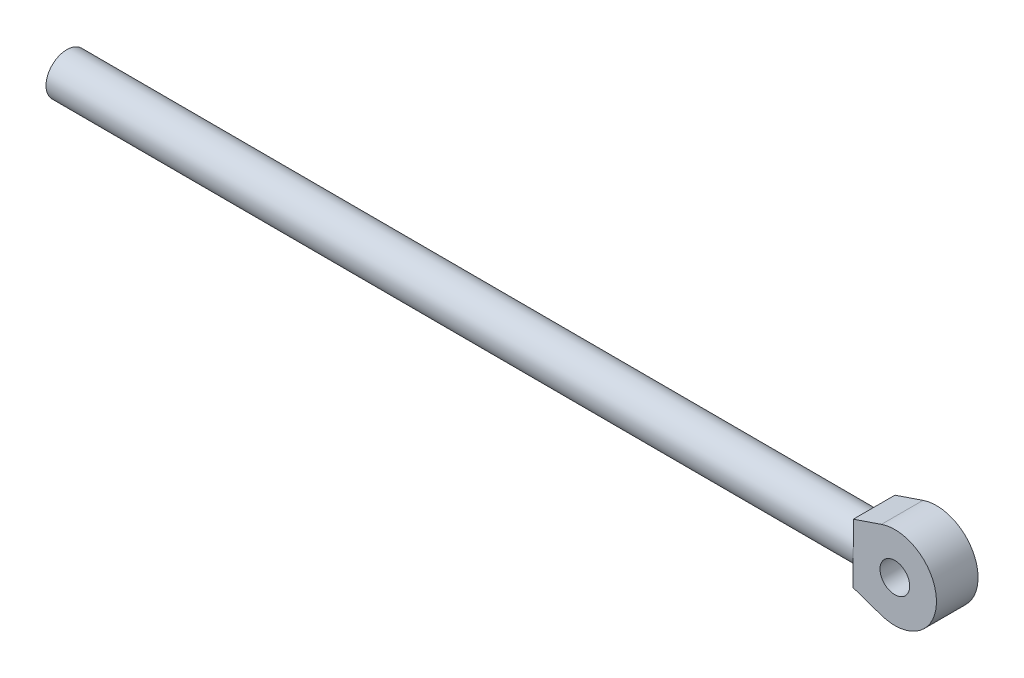
ISO-10303-21;
HEADER;
FILE_DESCRIPTION(('STEP AP214'),'2;1');
FILE_NAME('part.step','',(''),(''),'','','');
FILE_SCHEMA(('AUTOMOTIVE_DESIGN { 1 0 10303 214 1 1 1 1 }'));
ENDSEC;
DATA;
#1=APPLICATION_CONTEXT('core data for automotive mechanical design processes');
#2=APPLICATION_PROTOCOL_DEFINITION('international standard','automotive_design',2000,#1);
#3=PRODUCT_CONTEXT('',#1,'mechanical');
#4=PRODUCT('Part','Part','',(#3));
#5=PRODUCT_RELATED_PRODUCT_CATEGORY('part','',(#4));
#6=PRODUCT_DEFINITION_FORMATION('','',#4);
#7=PRODUCT_DEFINITION_CONTEXT('part definition',#1,'design');
#8=PRODUCT_DEFINITION('design','',#6,#7);
#9=PRODUCT_DEFINITION_SHAPE('','',#8);
#10=(LENGTH_UNIT() NAMED_UNIT(*) SI_UNIT(.MILLI.,.METRE.));
#11=(NAMED_UNIT(*) PLANE_ANGLE_UNIT() SI_UNIT($,.RADIAN.));
#12=(NAMED_UNIT(*) SI_UNIT($,.STERADIAN.) SOLID_ANGLE_UNIT());
#13=UNCERTAINTY_MEASURE_WITH_UNIT(LENGTH_MEASURE(1.E-05),#10,'distance_accuracy_value','');
#14=(GEOMETRIC_REPRESENTATION_CONTEXT(3) GLOBAL_UNCERTAINTY_ASSIGNED_CONTEXT((#13)) GLOBAL_UNIT_ASSIGNED_CONTEXT((#10,
#11,#12)) REPRESENTATION_CONTEXT('',''));
#15=CARTESIAN_POINT('',(0.,0.,0.));
#16=DIRECTION('',(0.,0.,1.));
#17=DIRECTION('',(1.,0.,0.));
#18=AXIS2_PLACEMENT_3D('',#15,#16,#17);
#19=CARTESIAN_POINT('',(767.138608193804,1961.0680369084,310.));
#20=DIRECTION('',(-0.999998110601927,0.00194391166865434,0.));
#21=DIRECTION('',(0.,0.,-1.));
#22=AXIS2_PLACEMENT_3D('',#19,#20,#21);
#23=CYLINDRICAL_SURFACE('',#22,17.5);
#24=CARTESIAN_POINT('',(767.138608193804,1961.0680369084,310.));
#25=DIRECTION('',(0.999998110601927,-0.00194391166865434,0.));
#26=DIRECTION('',(0.,0.,1.));
#27=AXIS2_PLACEMENT_3D('',#24,#25,#26);
#28=CIRCLE('',#27,17.5);
#29=CARTESIAN_POINT('',(767.138608193804,1961.0680369084,327.5));
#30=VERTEX_POINT('',#29);
#31=CARTESIAN_POINT('',(767.138608193804,1961.0680369084,292.5));
#32=VERTEX_POINT('',#31);
#33=EDGE_CURVE('E11',#30,#32,#28,.T.);
#34=ORIENTED_EDGE('',*,*,#33,.F.);
#35=EDGE_CURVE('E25',#32,#30,#28,.T.);
#36=ORIENTED_EDGE('',*,*,#35,.F.);
#37=EDGE_LOOP('',(#34,#36));
#38=FACE_BOUND('',#37,.T.);
#39=CARTESIAN_POINT('',(88.1398910950954,1962.38795293142,310.000000000001));
#40=DIRECTION('',(0.999998110601927,-0.00194391166865434,0.));
#41=DIRECTION('',(0.,0.,1.));
#42=AXIS2_PLACEMENT_3D('',#39,#40,#41);
#43=CIRCLE('',#42,17.5);
#44=CARTESIAN_POINT('',(88.1398910950954,1962.38795293142,327.500000000001));
#45=VERTEX_POINT('',#44);
#46=EDGE_CURVE('E19',#45,#45,#43,.T.);
#47=ORIENTED_EDGE('',*,*,#46,.T.);
#48=EDGE_LOOP('',(#47));
#49=FACE_BOUND('',#48,.T.);
#50=ADVANCED_FACE('F16',(#38,#49),#23,.T.);
#51=CARTESIAN_POINT('',(88.1398910950954,1962.38795293142,310.000000000001));
#52=DIRECTION('',(0.999998110601927,-0.00194391166865434,0.));
#53=DIRECTION('',(0.,0.,1.));
#54=AXIS2_PLACEMENT_3D('',#51,#52,#53);
#55=PLANE('',#54);
#56=ORIENTED_EDGE('',*,*,#46,.F.);
#57=EDGE_LOOP('',(#56));
#58=FACE_BOUND('',#57,.T.);
#59=ADVANCED_FACE('F138',(#58),#55,.F.);
#60=CARTESIAN_POINT('',(767.138608193804,1961.0680369084,327.5));
#61=DIRECTION('',(0.999998110601927,-0.00194391166865434,0.));
#62=DIRECTION('',(0.,0.,1.));
#63=AXIS2_PLACEMENT_3D('',#60,#61,#62);
#64=PLANE('',#63);
#65=DIRECTION('',(-0.00194391166865434,-0.999998110601927,0.));
#66=VECTOR('',#65,1.);
#67=CARTESIAN_POINT('',(767.138608193804,1961.0680369084,327.5));
#68=LINE('',#67,#66);
#69=CARTESIAN_POINT('',(767.090010402088,1936.06808414335,327.5));
#70=VERTEX_POINT('',#69);
#71=EDGE_CURVE('E32',#30,#70,#68,.T.);
#72=ORIENTED_EDGE('',*,*,#71,.F.);
#73=ORIENTED_EDGE('',*,*,#33,.T.);
#74=DIRECTION('',(-0.00194391166865434,-0.999998110601927,0.));
#75=VECTOR('',#74,1.);
#76=CARTESIAN_POINT('',(767.138608193804,1961.0680369084,292.5));
#77=LINE('',#76,#75);
#78=CARTESIAN_POINT('',(767.090010402088,1936.06808414335,292.5));
#79=VERTEX_POINT('',#78);
#80=EDGE_CURVE('E86',#32,#79,#77,.T.);
#81=ORIENTED_EDGE('',*,*,#80,.T.);
#82=DIRECTION('',(0.,0.,-1.));
#83=VECTOR('',#82,1.);
#84=CARTESIAN_POINT('',(767.090010402088,1936.06808414335,327.5));
#85=LINE('',#84,#83);
#86=EDGE_CURVE('E71',#70,#79,#85,.T.);
#87=ORIENTED_EDGE('',*,*,#86,.F.);
#88=EDGE_LOOP('',(#72,#73,#81,#87));
#89=FACE_BOUND('',#88,.T.);
#90=ADVANCED_FACE('F85',(#89),#64,.F.);
#91=CARTESIAN_POINT('',(767.090010402088,1936.06808414335,327.5));
#92=DIRECTION('',(0.326162546908811,0.945313700839017,0.));
#93=DIRECTION('',(-0.945313700839017,0.326162546908811,0.));
#94=AXIS2_PLACEMENT_3D('',#91,#92,#93);
#95=PLANE('',#94);
#96=DIRECTION('',(0.945313700839017,-0.326162546908811,0.));
#97=VECTOR('',#96,1.);
#98=CARTESIAN_POINT('',(767.090010402088,1936.06808414335,292.5));
#99=LINE('',#98,#97);
#100=CARTESIAN_POINT('',(790.722852923063,1927.91402047063,292.5));
#101=VERTEX_POINT('',#100);
#102=EDGE_CURVE('E45',#79,#101,#99,.T.);
#103=ORIENTED_EDGE('',*,*,#102,.T.);
#104=DIRECTION('',(0.,0.,-1.));
#105=VECTOR('',#104,1.);
#106=CARTESIAN_POINT('',(790.722852923063,1927.91402047063,327.5));
#107=LINE('',#106,#105);
#108=CARTESIAN_POINT('',(790.722852923063,1927.91402047063,327.5));
#109=VERTEX_POINT('',#108);
#110=EDGE_CURVE('E74',#109,#101,#107,.T.);
#111=ORIENTED_EDGE('',*,*,#110,.F.);
#112=DIRECTION('',(0.945313700839017,-0.326162546908811,0.));
#113=VECTOR('',#112,1.);
#114=CARTESIAN_POINT('',(767.090010402088,1936.06808414335,327.5));
#115=LINE('',#114,#113);
#116=EDGE_CURVE('E69',#70,#109,#115,.T.);
#117=ORIENTED_EDGE('',*,*,#116,.F.);
#118=ORIENTED_EDGE('',*,*,#86,.T.);
#119=EDGE_LOOP('',(#103,#111,#117,#118));
#120=FACE_BOUND('',#119,.T.);
#121=ADVANCED_FACE('F70',(#120),#95,.F.);
#122=CARTESIAN_POINT('',(802.138542064872,1961.,327.5));
#123=DIRECTION('',(0.,0.,-1.));
#124=DIRECTION('',(0.999998110601927,-0.00194391166865434,0.));
#125=AXIS2_PLACEMENT_3D('',#122,#123,#124);
#126=CYLINDRICAL_SURFACE('',#125,35.);
#127=CARTESIAN_POINT('',(802.138542064872,1961.,292.5));
#128=DIRECTION('',(0.,0.,1.));
#129=DIRECTION('',(-0.999998110601927,0.00194391166865434,0.));
#130=AXIS2_PLACEMENT_3D('',#127,#128,#129);
#131=CIRCLE('',#130,35.);
#132=CARTESIAN_POINT('',(790.85157139842,1994.13011157806,292.5));
#133=VERTEX_POINT('',#132);
#134=EDGE_CURVE('E83',#101,#133,#131,.T.);
#135=ORIENTED_EDGE('',*,*,#134,.T.);
#136=DIRECTION('',(0.,0.,-1.));
#137=VECTOR('',#136,1.);
#138=CARTESIAN_POINT('',(790.85157139842,1994.13011157806,327.5));
#139=LINE('',#138,#137);
#140=CARTESIAN_POINT('',(790.85157139842,1994.13011157806,327.5));
#141=VERTEX_POINT('',#140);
#142=EDGE_CURVE('E94',#141,#133,#139,.T.);
#143=ORIENTED_EDGE('',*,*,#142,.F.);
#144=CARTESIAN_POINT('',(802.138542064872,1961.,327.5));
#145=DIRECTION('',(0.,0.,1.));
#146=DIRECTION('',(-0.999998110601927,0.00194391166865434,0.));
#147=AXIS2_PLACEMENT_3D('',#144,#145,#146);
#148=CIRCLE('',#147,35.);
#149=EDGE_CURVE('E77',#109,#141,#148,.T.);
#150=ORIENTED_EDGE('',*,*,#149,.F.);
#151=ORIENTED_EDGE('',*,*,#110,.T.);
#152=EDGE_LOOP('',(#135,#143,#150,#151));
#153=FACE_BOUND('',#152,.T.);
#154=ADVANCED_FACE('F125',(#153),#126,.T.);
#155=CARTESIAN_POINT('',(802.138542064872,1961.,327.5));
#156=DIRECTION('',(0.,0.,1.));
#157=DIRECTION('',(-0.999998110601927,0.00194391166865434,0.));
#158=AXIS2_PLACEMENT_3D('',#155,#156,#157);
#159=PLANE('',#158);
#160=CARTESIAN_POINT('',(802.138542064872,1961.,327.5));
#161=DIRECTION('',(0.,0.,1.));
#162=DIRECTION('',(-0.999998110601927,0.00194391166865434,0.));
#163=AXIS2_PLACEMENT_3D('',#160,#161,#162);
#164=CIRCLE('',#163,12.5);
#165=CARTESIAN_POINT('',(789.638565682347,1961.02429889586,327.5));
#166=VERTEX_POINT('',#165);
#167=EDGE_CURVE('E109',#166,#166,#164,.T.);
#168=ORIENTED_EDGE('',*,*,#167,.F.);
#169=EDGE_LOOP('',(#168));
#170=FACE_BOUND('',#169,.T.);
#171=ORIENTED_EDGE('',*,*,#71,.T.);
#172=ORIENTED_EDGE('',*,*,#116,.T.);
#173=ORIENTED_EDGE('',*,*,#149,.T.);
#174=DIRECTION('',(0.946574616515981,0.32248487618433,0.));
#175=VECTOR('',#174,1.);
#176=CARTESIAN_POINT('',(767.18720598552,1986.06798967345,327.5));
#177=LINE('',#176,#175);
#178=CARTESIAN_POINT('',(767.18720598552,1986.06798967345,327.5));
#179=VERTEX_POINT('',#178);
#180=EDGE_CURVE('E99',#179,#141,#177,.T.);
#181=ORIENTED_EDGE('',*,*,#180,.F.);
#182=DIRECTION('',(0.00194391166865409,0.999998110601927,0.));
#183=VECTOR('',#182,1.);
#184=CARTESIAN_POINT('',(767.138608193804,1961.0680369084,327.5));
#185=LINE('',#184,#183);
#186=EDGE_CURVE('E82',#30,#179,#185,.T.);
#187=ORIENTED_EDGE('',*,*,#186,.F.);
#188=EDGE_LOOP('',(#171,#172,#173,#181,#187));
#189=FACE_BOUND('',#188,.T.);
#190=ADVANCED_FACE('F80',(#170,#189),#159,.T.);
#191=CARTESIAN_POINT('',(802.138542064872,1961.,292.5));
#192=DIRECTION('',(0.,0.,1.));
#193=DIRECTION('',(-0.999998110601927,0.00194391166865434,0.));
#194=AXIS2_PLACEMENT_3D('',#191,#192,#193);
#195=PLANE('',#194);
#196=CARTESIAN_POINT('',(802.138542064872,1961.,292.5));
#197=DIRECTION('',(0.,0.,1.));
#198=DIRECTION('',(-0.999998110601927,0.00194391166865434,0.));
#199=AXIS2_PLACEMENT_3D('',#196,#197,#198);
#200=CIRCLE('',#199,12.5);
#201=CARTESIAN_POINT('',(789.638565682347,1961.02429889586,292.5));
#202=VERTEX_POINT('',#201);
#203=EDGE_CURVE('E106',#202,#202,#200,.T.);
#204=ORIENTED_EDGE('',*,*,#203,.T.);
#205=EDGE_LOOP('',(#204));
#206=FACE_BOUND('',#205,.T.);
#207=ORIENTED_EDGE('',*,*,#80,.F.);
#208=DIRECTION('',(0.00194391166865409,0.999998110601927,0.));
#209=VECTOR('',#208,1.);
#210=CARTESIAN_POINT('',(767.138608193804,1961.0680369084,292.5));
#211=LINE('',#210,#209);
#212=CARTESIAN_POINT('',(767.18720598552,1986.06798967345,292.5));
#213=VERTEX_POINT('',#212);
#214=EDGE_CURVE('E103',#32,#213,#211,.T.);
#215=ORIENTED_EDGE('',*,*,#214,.T.);
#216=DIRECTION('',(0.946574616515981,0.32248487618433,0.));
#217=VECTOR('',#216,1.);
#218=CARTESIAN_POINT('',(767.18720598552,1986.06798967345,292.5));
#219=LINE('',#218,#217);
#220=EDGE_CURVE('E100',#213,#133,#219,.T.);
#221=ORIENTED_EDGE('',*,*,#220,.T.);
#222=ORIENTED_EDGE('',*,*,#134,.F.);
#223=ORIENTED_EDGE('',*,*,#102,.F.);
#224=EDGE_LOOP('',(#207,#215,#221,#222,#223));
#225=FACE_BOUND('',#224,.T.);
#226=ADVANCED_FACE('F115',(#206,#225),#195,.F.);
#227=CARTESIAN_POINT('',(767.138608193804,1961.0680369084,327.5));
#228=DIRECTION('',(-0.999998110601927,0.00194391166865409,0.));
#229=DIRECTION('',(-0.00194391166865409,-0.999998110601927,0.));
#230=AXIS2_PLACEMENT_3D('',#227,#228,#229);
#231=PLANE('',#230);
#232=ORIENTED_EDGE('',*,*,#35,.T.);
#233=ORIENTED_EDGE('',*,*,#186,.T.);
#234=DIRECTION('',(0.,0.,-1.));
#235=VECTOR('',#234,1.);
#236=CARTESIAN_POINT('',(767.18720598552,1986.06798967345,327.5));
#237=LINE('',#236,#235);
#238=EDGE_CURVE('E54',#179,#213,#237,.T.);
#239=ORIENTED_EDGE('',*,*,#238,.T.);
#240=ORIENTED_EDGE('',*,*,#214,.F.);
#241=EDGE_LOOP('',(#232,#233,#239,#240));
#242=FACE_BOUND('',#241,.T.);
#243=ADVANCED_FACE('F132',(#242),#231,.T.);
#244=CARTESIAN_POINT('',(767.18720598552,1986.06798967345,327.5));
#245=DIRECTION('',(-0.32248487618433,0.946574616515982,0.));
#246=DIRECTION('',(-0.946574616515982,-0.32248487618433,0.));
#247=AXIS2_PLACEMENT_3D('',#244,#245,#246);
#248=PLANE('',#247);
#249=ORIENTED_EDGE('',*,*,#220,.F.);
#250=ORIENTED_EDGE('',*,*,#238,.F.);
#251=ORIENTED_EDGE('',*,*,#180,.T.);
#252=ORIENTED_EDGE('',*,*,#142,.T.);
#253=EDGE_LOOP('',(#249,#250,#251,#252));
#254=FACE_BOUND('',#253,.T.);
#255=ADVANCED_FACE('F120',(#254),#248,.T.);
#256=CARTESIAN_POINT('',(802.138542064872,1961.,292.5));
#257=DIRECTION('',(0.,0.,1.));
#258=DIRECTION('',(-0.999998110601927,0.00194391166865434,0.));
#259=AXIS2_PLACEMENT_3D('',#256,#257,#258);
#260=CYLINDRICAL_SURFACE('',#259,12.5);
#261=ORIENTED_EDGE('',*,*,#203,.F.);
#262=EDGE_LOOP('',(#261));
#263=FACE_BOUND('',#262,.T.);
#264=ORIENTED_EDGE('',*,*,#167,.T.);
#265=EDGE_LOOP('',(#264));
#266=FACE_BOUND('',#265,.T.);
#267=ADVANCED_FACE('F117',(#263,#266),#260,.F.);
#268=CLOSED_SHELL('',(#50,#59,#90,#121,#154,#190,#226,#243,#255,#267));
#269=MANIFOLD_SOLID_BREP('B1',#268);
#270=ADVANCED_BREP_SHAPE_REPRESENTATION('',(#18,#269),#14);
#271=SHAPE_DEFINITION_REPRESENTATION(#9,#270);
ENDSEC;
END-ISO-10303-21;
